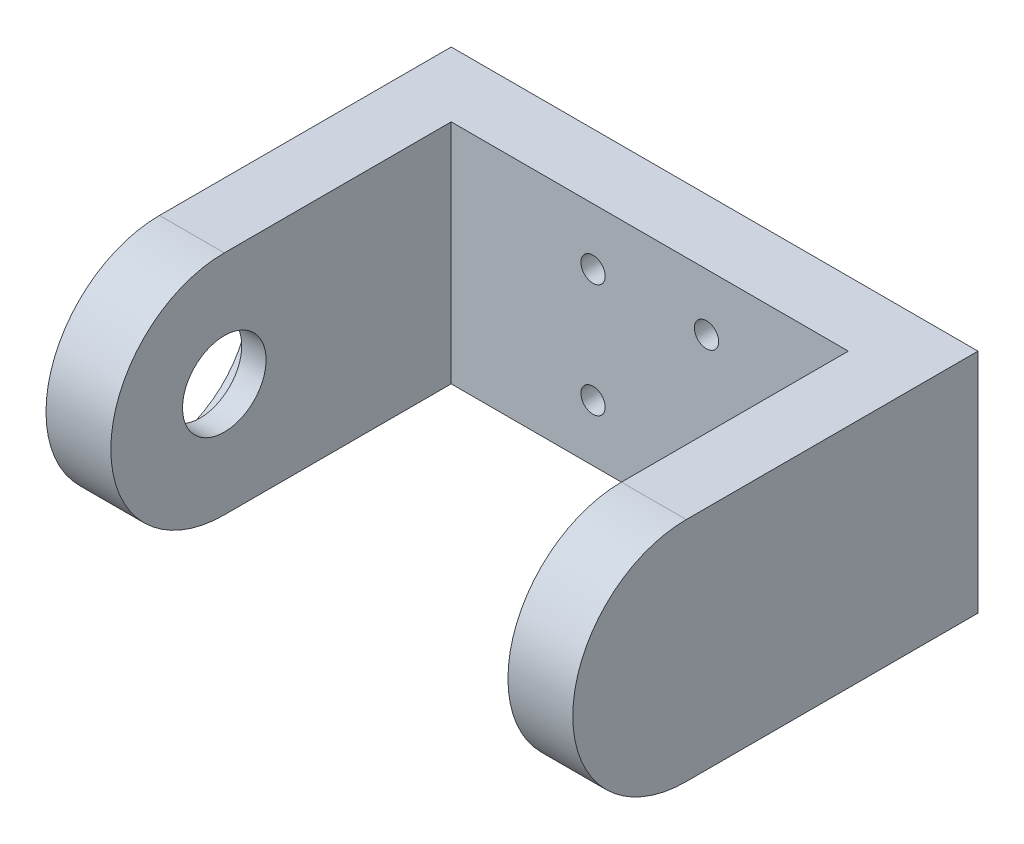
ISO-10303-21;
HEADER;
FILE_DESCRIPTION(('STEP AP214'),'2;1');
FILE_NAME('part.step','',(''),(''),'','','');
FILE_SCHEMA(('AUTOMOTIVE_DESIGN { 1 0 10303 214 1 1 1 1 }'));
ENDSEC;
DATA;
#1=APPLICATION_CONTEXT('core data for automotive mechanical design processes');
#2=APPLICATION_PROTOCOL_DEFINITION('international standard','automotive_design',2000,#1);
#3=PRODUCT_CONTEXT('',#1,'mechanical');
#4=PRODUCT('Part','Part','',(#3));
#5=PRODUCT_RELATED_PRODUCT_CATEGORY('part','',(#4));
#6=PRODUCT_DEFINITION_FORMATION('','',#4);
#7=PRODUCT_DEFINITION_CONTEXT('part definition',#1,'design');
#8=PRODUCT_DEFINITION('design','',#6,#7);
#9=PRODUCT_DEFINITION_SHAPE('','',#8);
#10=(LENGTH_UNIT() NAMED_UNIT(*) SI_UNIT(.MILLI.,.METRE.));
#11=(NAMED_UNIT(*) PLANE_ANGLE_UNIT() SI_UNIT($,.RADIAN.));
#12=(NAMED_UNIT(*) SI_UNIT($,.STERADIAN.) SOLID_ANGLE_UNIT());
#13=UNCERTAINTY_MEASURE_WITH_UNIT(LENGTH_MEASURE(1.E-05),#10,'distance_accuracy_value','');
#14=(GEOMETRIC_REPRESENTATION_CONTEXT(3) GLOBAL_UNCERTAINTY_ASSIGNED_CONTEXT((#13)) GLOBAL_UNIT_ASSIGNED_CONTEXT((#10,
#11,#12)) REPRESENTATION_CONTEXT('',''));
#15=CARTESIAN_POINT('',(0.,0.,0.));
#16=DIRECTION('',(0.,0.,1.));
#17=DIRECTION('',(1.,0.,0.));
#18=AXIS2_PLACEMENT_3D('',#15,#16,#17);
#19=CARTESIAN_POINT('',(0.,0.,8.));
#20=DIRECTION('',(0.,0.,-1.));
#21=DIRECTION('',(-1.,0.,0.));
#22=AXIS2_PLACEMENT_3D('',#19,#20,#21);
#23=PLANE('',#22);
#24=CARTESIAN_POINT('',(39.5,7.,8.));
#25=DIRECTION('',(0.,0.,1.));
#26=DIRECTION('',(1.,0.,0.));
#27=AXIS2_PLACEMENT_3D('',#24,#25,#26);
#28=CIRCLE('',#27,1.5);
#29=CARTESIAN_POINT('',(41.,7.,8.));
#30=VERTEX_POINT('',#29);
#31=EDGE_CURVE('E397',#30,#30,#28,.T.);
#32=ORIENTED_EDGE('',*,*,#31,.F.);
#33=EDGE_LOOP('',(#32));
#34=FACE_BOUND('',#33,.T.);
#35=CARTESIAN_POINT('',(25.5,7.,8.));
#36=DIRECTION('',(0.,0.,1.));
#37=DIRECTION('',(1.,0.,0.));
#38=AXIS2_PLACEMENT_3D('',#35,#36,#37);
#39=CIRCLE('',#38,1.5);
#40=CARTESIAN_POINT('',(27.,7.,8.));
#41=VERTEX_POINT('',#40);
#42=EDGE_CURVE('E399',#41,#41,#39,.T.);
#43=ORIENTED_EDGE('',*,*,#42,.F.);
#44=EDGE_LOOP('',(#43));
#45=FACE_BOUND('',#44,.T.);
#46=CARTESIAN_POINT('',(25.5,21.,8.));
#47=DIRECTION('',(0.,0.,1.));
#48=DIRECTION('',(1.,0.,0.));
#49=AXIS2_PLACEMENT_3D('',#46,#47,#48);
#50=CIRCLE('',#49,1.5);
#51=CARTESIAN_POINT('',(27.,21.,8.));
#52=VERTEX_POINT('',#51);
#53=EDGE_CURVE('E433',#52,#52,#50,.T.);
#54=ORIENTED_EDGE('',*,*,#53,.F.);
#55=EDGE_LOOP('',(#54));
#56=FACE_BOUND('',#55,.T.);
#57=CARTESIAN_POINT('',(39.5,21.,8.));
#58=DIRECTION('',(0.,0.,1.));
#59=DIRECTION('',(1.,0.,0.));
#60=AXIS2_PLACEMENT_3D('',#57,#58,#59);
#61=CIRCLE('',#60,1.5);
#62=CARTESIAN_POINT('',(41.,21.,8.));
#63=VERTEX_POINT('',#62);
#64=EDGE_CURVE('E407',#63,#63,#61,.T.);
#65=ORIENTED_EDGE('',*,*,#64,.F.);
#66=EDGE_LOOP('',(#65));
#67=FACE_BOUND('',#66,.T.);
#68=DIRECTION('',(0.,-1.,0.));
#69=VECTOR('',#68,1.);
#70=CARTESIAN_POINT('',(57.,0.,8.));
#71=LINE('',#70,#69);
#72=CARTESIAN_POINT('',(57.,28.,8.));
#73=VERTEX_POINT('',#72);
#74=CARTESIAN_POINT('',(57.,0.,8.));
#75=VERTEX_POINT('',#74);
#76=EDGE_CURVE('E110',#73,#75,#71,.T.);
#77=ORIENTED_EDGE('',*,*,#76,.F.);
#78=DIRECTION('',(-1.,0.,0.));
#79=VECTOR('',#78,1.);
#80=CARTESIAN_POINT('',(0.,28.,8.));
#81=LINE('',#80,#79);
#82=CARTESIAN_POINT('',(8.,28.,8.));
#83=VERTEX_POINT('',#82);
#84=EDGE_CURVE('E160',#73,#83,#81,.T.);
#85=ORIENTED_EDGE('',*,*,#84,.T.);
#86=DIRECTION('',(0.,1.,0.));
#87=VECTOR('',#86,1.);
#88=CARTESIAN_POINT('',(8.,0.,8.));
#89=LINE('',#88,#87);
#90=CARTESIAN_POINT('',(8.,0.,8.));
#91=VERTEX_POINT('',#90);
#92=EDGE_CURVE('E54',#91,#83,#89,.T.);
#93=ORIENTED_EDGE('',*,*,#92,.F.);
#94=DIRECTION('',(1.,0.,0.));
#95=VECTOR('',#94,1.);
#96=CARTESIAN_POINT('',(0.,0.,8.));
#97=LINE('',#96,#95);
#98=EDGE_CURVE('E49',#91,#75,#97,.T.);
#99=ORIENTED_EDGE('',*,*,#98,.T.);
#100=EDGE_LOOP('',(#77,#85,#93,#99));
#101=FACE_BOUND('',#100,.T.);
#102=ADVANCED_FACE('F33',(#34,#45,#56,#67,#101),#23,.F.);
#103=CARTESIAN_POINT('',(0.,0.,8.));
#104=DIRECTION('',(1.,0.,0.));
#105=DIRECTION('',(0.,0.,-1.));
#106=AXIS2_PLACEMENT_3D('',#103,#104,#105);
#107=PLANE('',#106);
#108=CARTESIAN_POINT('',(0.,14.,36.0000000000001));
#109=DIRECTION('',(-1.,0.,0.));
#110=DIRECTION('',(0.,0.,1.));
#111=AXIS2_PLACEMENT_3D('',#108,#109,#110);
#112=CIRCLE('',#111,11.115);
#113=CARTESIAN_POINT('',(0.,14.,47.1150000000001));
#114=VERTEX_POINT('',#113);
#115=EDGE_CURVE('E130',#114,#114,#112,.T.);
#116=ORIENTED_EDGE('',*,*,#115,.F.);
#117=EDGE_LOOP('',(#116));
#118=FACE_BOUND('',#117,.T.);
#119=DIRECTION('',(0.,0.,-1.));
#120=VECTOR('',#119,1.);
#121=CARTESIAN_POINT('',(0.,0.,8.));
#122=LINE('',#121,#120);
#123=CARTESIAN_POINT('',(0.,0.,36.));
#124=VERTEX_POINT('',#123);
#125=CARTESIAN_POINT('',(0.,0.,0.));
#126=VERTEX_POINT('',#125);
#127=EDGE_CURVE('E11',#124,#126,#122,.T.);
#128=ORIENTED_EDGE('',*,*,#127,.F.);
#129=CARTESIAN_POINT('',(0.,14.,36.));
#130=DIRECTION('',(-1.,0.,0.));
#131=DIRECTION('',(0.,0.,1.));
#132=AXIS2_PLACEMENT_3D('',#129,#130,#131);
#133=CIRCLE('',#132,14.);
#134=CARTESIAN_POINT('',(0.,28.,36.));
#135=VERTEX_POINT('',#134);
#136=EDGE_CURVE('E127',#124,#135,#133,.T.);
#137=ORIENTED_EDGE('',*,*,#136,.T.);
#138=DIRECTION('',(0.,0.,-1.));
#139=VECTOR('',#138,1.);
#140=CARTESIAN_POINT('',(0.,28.,8.));
#141=LINE('',#140,#139);
#142=CARTESIAN_POINT('',(0.,28.,0.));
#143=VERTEX_POINT('',#142);
#144=EDGE_CURVE('E119',#135,#143,#141,.T.);
#145=ORIENTED_EDGE('',*,*,#144,.T.);
#146=DIRECTION('',(0.,-1.,0.));
#147=VECTOR('',#146,1.);
#148=CARTESIAN_POINT('',(0.,0.,0.));
#149=LINE('',#148,#147);
#150=EDGE_CURVE('E158',#143,#126,#149,.T.);
#151=ORIENTED_EDGE('',*,*,#150,.T.);
#152=EDGE_LOOP('',(#128,#137,#145,#151));
#153=FACE_BOUND('',#152,.T.);
#154=ADVANCED_FACE('F35',(#118,#153),#107,.F.);
#155=CARTESIAN_POINT('',(0.,0.,8.));
#156=DIRECTION('',(0.,1.,0.));
#157=DIRECTION('',(0.,0.,1.));
#158=AXIS2_PLACEMENT_3D('',#155,#156,#157);
#159=PLANE('',#158);
#160=DIRECTION('',(1.,0.,0.));
#161=VECTOR('',#160,1.);
#162=CARTESIAN_POINT('',(0.,0.,0.));
#163=LINE('',#162,#161);
#164=CARTESIAN_POINT('',(65.,0.,0.));
#165=VERTEX_POINT('',#164);
#166=EDGE_CURVE('E165',#126,#165,#163,.T.);
#167=ORIENTED_EDGE('',*,*,#166,.T.);
#168=DIRECTION('',(0.,0.,-1.));
#169=VECTOR('',#168,1.);
#170=CARTESIAN_POINT('',(65.,0.,8.));
#171=LINE('',#170,#169);
#172=CARTESIAN_POINT('',(65.,0.,36.));
#173=VERTEX_POINT('',#172);
#174=EDGE_CURVE('E42',#173,#165,#171,.T.);
#175=ORIENTED_EDGE('',*,*,#174,.F.);
#176=DIRECTION('',(1.,0.,0.));
#177=VECTOR('',#176,1.);
#178=CARTESIAN_POINT('',(65.,0.,36.));
#179=LINE('',#178,#177);
#180=CARTESIAN_POINT('',(57.,0.,36.));
#181=VERTEX_POINT('',#180);
#182=EDGE_CURVE('E109',#181,#173,#179,.T.);
#183=ORIENTED_EDGE('',*,*,#182,.F.);
#184=DIRECTION('',(0.,0.,-1.));
#185=VECTOR('',#184,1.);
#186=CARTESIAN_POINT('',(57.,0.,36.));
#187=LINE('',#186,#185);
#188=EDGE_CURVE('E140',#181,#75,#187,.T.);
#189=ORIENTED_EDGE('',*,*,#188,.T.);
#190=ORIENTED_EDGE('',*,*,#98,.F.);
#191=DIRECTION('',(0.,0.,-1.));
#192=VECTOR('',#191,1.);
#193=CARTESIAN_POINT('',(8.,0.,36.));
#194=LINE('',#193,#192);
#195=CARTESIAN_POINT('',(8.,0.,36.));
#196=VERTEX_POINT('',#195);
#197=EDGE_CURVE('E155',#196,#91,#194,.T.);
#198=ORIENTED_EDGE('',*,*,#197,.F.);
#199=DIRECTION('',(1.,0.,0.));
#200=VECTOR('',#199,1.);
#201=CARTESIAN_POINT('',(0.,0.,36.));
#202=LINE('',#201,#200);
#203=EDGE_CURVE('E145',#124,#196,#202,.T.);
#204=ORIENTED_EDGE('',*,*,#203,.F.);
#205=ORIENTED_EDGE('',*,*,#127,.T.);
#206=EDGE_LOOP('',(#167,#175,#183,#189,#190,#198,#204,#205));
#207=FACE_BOUND('',#206,.T.);
#208=ADVANCED_FACE('F184',(#207),#159,.F.);
#209=CARTESIAN_POINT('',(65.,0.,8.));
#210=DIRECTION('',(-1.,0.,0.));
#211=DIRECTION('',(0.,0.,1.));
#212=AXIS2_PLACEMENT_3D('',#209,#210,#211);
#213=PLANE('',#212);
#214=DIRECTION('',(0.,0.,-1.));
#215=VECTOR('',#214,1.);
#216=CARTESIAN_POINT('',(65.,28.,8.));
#217=LINE('',#216,#215);
#218=CARTESIAN_POINT('',(65.,28.,36.));
#219=VERTEX_POINT('',#218);
#220=CARTESIAN_POINT('',(65.,28.,0.));
#221=VERTEX_POINT('',#220);
#222=EDGE_CURVE('E101',#219,#221,#217,.T.);
#223=ORIENTED_EDGE('',*,*,#222,.F.);
#224=CARTESIAN_POINT('',(65.,14.,36.));
#225=DIRECTION('',(1.,0.,0.));
#226=DIRECTION('',(0.,0.,-1.));
#227=AXIS2_PLACEMENT_3D('',#224,#225,#226);
#228=CIRCLE('',#227,14.);
#229=EDGE_CURVE('E116',#219,#173,#228,.T.);
#230=ORIENTED_EDGE('',*,*,#229,.T.);
#231=ORIENTED_EDGE('',*,*,#174,.T.);
#232=DIRECTION('',(0.,1.,0.));
#233=VECTOR('',#232,1.);
#234=CARTESIAN_POINT('',(65.,0.,0.));
#235=LINE('',#234,#233);
#236=EDGE_CURVE('E118',#165,#221,#235,.T.);
#237=ORIENTED_EDGE('',*,*,#236,.T.);
#238=EDGE_LOOP('',(#223,#230,#231,#237));
#239=FACE_BOUND('',#238,.T.);
#240=ADVANCED_FACE('F114',(#239),#213,.F.);
#241=CARTESIAN_POINT('',(0.,28.,8.));
#242=DIRECTION('',(0.,-1.,0.));
#243=DIRECTION('',(0.,0.,-1.));
#244=AXIS2_PLACEMENT_3D('',#241,#242,#243);
#245=PLANE('',#244);
#246=DIRECTION('',(-1.,0.,0.));
#247=VECTOR('',#246,1.);
#248=CARTESIAN_POINT('',(0.,28.,0.));
#249=LINE('',#248,#247);
#250=EDGE_CURVE('E161',#221,#143,#249,.T.);
#251=ORIENTED_EDGE('',*,*,#250,.T.);
#252=ORIENTED_EDGE('',*,*,#144,.F.);
#253=DIRECTION('',(-1.,0.,0.));
#254=VECTOR('',#253,1.);
#255=CARTESIAN_POINT('',(0.,28.,36.));
#256=LINE('',#255,#254);
#257=CARTESIAN_POINT('',(8.,28.,36.));
#258=VERTEX_POINT('',#257);
#259=EDGE_CURVE('E148',#258,#135,#256,.T.);
#260=ORIENTED_EDGE('',*,*,#259,.F.);
#261=DIRECTION('',(0.,0.,-1.));
#262=VECTOR('',#261,1.);
#263=CARTESIAN_POINT('',(8.,28.,36.));
#264=LINE('',#263,#262);
#265=EDGE_CURVE('E151',#258,#83,#264,.T.);
#266=ORIENTED_EDGE('',*,*,#265,.T.);
#267=ORIENTED_EDGE('',*,*,#84,.F.);
#268=DIRECTION('',(0.,0.,-1.));
#269=VECTOR('',#268,1.);
#270=CARTESIAN_POINT('',(57.,28.,36.));
#271=LINE('',#270,#269);
#272=CARTESIAN_POINT('',(57.,28.,36.));
#273=VERTEX_POINT('',#272);
#274=EDGE_CURVE('E104',#273,#73,#271,.T.);
#275=ORIENTED_EDGE('',*,*,#274,.F.);
#276=DIRECTION('',(-1.,0.,0.));
#277=VECTOR('',#276,1.);
#278=CARTESIAN_POINT('',(65.,28.,36.));
#279=LINE('',#278,#277);
#280=EDGE_CURVE('E98',#219,#273,#279,.T.);
#281=ORIENTED_EDGE('',*,*,#280,.F.);
#282=ORIENTED_EDGE('',*,*,#222,.T.);
#283=EDGE_LOOP('',(#251,#252,#260,#266,#267,#275,#281,#282));
#284=FACE_BOUND('',#283,.T.);
#285=ADVANCED_FACE('F100',(#284),#245,.F.);
#286=CARTESIAN_POINT('',(0.,0.,0.));
#287=DIRECTION('',(0.,0.,-1.));
#288=DIRECTION('',(-1.,0.,0.));
#289=AXIS2_PLACEMENT_3D('',#286,#287,#288);
#290=PLANE('',#289);
#291=CARTESIAN_POINT('',(39.5,7.,0.));
#292=DIRECTION('',(0.,0.,1.));
#293=DIRECTION('',(1.,0.,0.));
#294=AXIS2_PLACEMENT_3D('',#291,#292,#293);
#295=CIRCLE('',#294,1.5);
#296=CARTESIAN_POINT('',(41.,7.,0.));
#297=VERTEX_POINT('',#296);
#298=EDGE_CURVE('E395',#297,#297,#295,.T.);
#299=ORIENTED_EDGE('',*,*,#298,.T.);
#300=EDGE_LOOP('',(#299));
#301=FACE_BOUND('',#300,.T.);
#302=CARTESIAN_POINT('',(25.5,7.,0.));
#303=DIRECTION('',(0.,0.,1.));
#304=DIRECTION('',(1.,0.,0.));
#305=AXIS2_PLACEMENT_3D('',#302,#303,#304);
#306=CIRCLE('',#305,1.5);
#307=CARTESIAN_POINT('',(27.,7.,0.));
#308=VERTEX_POINT('',#307);
#309=EDGE_CURVE('E438',#308,#308,#306,.T.);
#310=ORIENTED_EDGE('',*,*,#309,.T.);
#311=EDGE_LOOP('',(#310));
#312=FACE_BOUND('',#311,.T.);
#313=CARTESIAN_POINT('',(25.5,21.,0.));
#314=DIRECTION('',(0.,0.,1.));
#315=DIRECTION('',(1.,0.,0.));
#316=AXIS2_PLACEMENT_3D('',#313,#314,#315);
#317=CIRCLE('',#316,1.5);
#318=CARTESIAN_POINT('',(27.,21.,0.));
#319=VERTEX_POINT('',#318);
#320=EDGE_CURVE('E410',#319,#319,#317,.T.);
#321=ORIENTED_EDGE('',*,*,#320,.T.);
#322=EDGE_LOOP('',(#321));
#323=FACE_BOUND('',#322,.T.);
#324=CARTESIAN_POINT('',(39.5,21.,0.));
#325=DIRECTION('',(0.,0.,1.));
#326=DIRECTION('',(1.,0.,0.));
#327=AXIS2_PLACEMENT_3D('',#324,#325,#326);
#328=CIRCLE('',#327,1.5);
#329=CARTESIAN_POINT('',(41.,21.,0.));
#330=VERTEX_POINT('',#329);
#331=EDGE_CURVE('E403',#330,#330,#328,.T.);
#332=ORIENTED_EDGE('',*,*,#331,.T.);
#333=EDGE_LOOP('',(#332));
#334=FACE_BOUND('',#333,.T.);
#335=ORIENTED_EDGE('',*,*,#150,.F.);
#336=ORIENTED_EDGE('',*,*,#250,.F.);
#337=ORIENTED_EDGE('',*,*,#236,.F.);
#338=ORIENTED_EDGE('',*,*,#166,.F.);
#339=EDGE_LOOP('',(#335,#336,#337,#338));
#340=FACE_BOUND('',#339,.T.);
#341=ADVANCED_FACE('F174',(#301,#312,#323,#334,#340),#290,.T.);
#342=CARTESIAN_POINT('',(8.,0.,36.));
#343=DIRECTION('',(-1.,0.,0.));
#344=DIRECTION('',(0.,0.,1.));
#345=AXIS2_PLACEMENT_3D('',#342,#343,#344);
#346=PLANE('',#345);
#347=CARTESIAN_POINT('',(8.,14.,36.0000000000001));
#348=DIRECTION('',(-1.,0.,0.));
#349=DIRECTION('',(0.,0.,1.));
#350=AXIS2_PLACEMENT_3D('',#347,#348,#349);
#351=CIRCLE('',#350,5.155);
#352=CARTESIAN_POINT('',(8.,14.,41.1550000000001));
#353=VERTEX_POINT('',#352);
#354=EDGE_CURVE('E414',#353,#353,#351,.T.);
#355=ORIENTED_EDGE('',*,*,#354,.T.);
#356=EDGE_LOOP('',(#355));
#357=FACE_BOUND('',#356,.T.);
#358=ORIENTED_EDGE('',*,*,#265,.F.);
#359=CARTESIAN_POINT('',(8.00000000000002,14.,36.));
#360=DIRECTION('',(-1.,0.,0.));
#361=DIRECTION('',(0.,0.,1.));
#362=AXIS2_PLACEMENT_3D('',#359,#360,#361);
#363=CIRCLE('',#362,14.);
#364=EDGE_CURVE('E134',#196,#258,#363,.T.);
#365=ORIENTED_EDGE('',*,*,#364,.F.);
#366=ORIENTED_EDGE('',*,*,#197,.T.);
#367=ORIENTED_EDGE('',*,*,#92,.T.);
#368=EDGE_LOOP('',(#358,#365,#366,#367));
#369=FACE_BOUND('',#368,.T.);
#370=ADVANCED_FACE('F183',(#357,#369),#346,.F.);
#371=CARTESIAN_POINT('',(57.,0.,36.));
#372=DIRECTION('',(1.,0.,0.));
#373=DIRECTION('',(0.,0.,-1.));
#374=AXIS2_PLACEMENT_3D('',#371,#372,#373);
#375=PLANE('',#374);
#376=CARTESIAN_POINT('',(57.,14.,36.));
#377=DIRECTION('',(1.,0.,0.));
#378=DIRECTION('',(0.,0.,-1.));
#379=AXIS2_PLACEMENT_3D('',#376,#377,#378);
#380=CIRCLE('',#379,6.5);
#381=CARTESIAN_POINT('',(57.,14.,29.5));
#382=VERTEX_POINT('',#381);
#383=EDGE_CURVE('E406',#382,#382,#380,.T.);
#384=ORIENTED_EDGE('',*,*,#383,.T.);
#385=EDGE_LOOP('',(#384));
#386=FACE_BOUND('',#385,.T.);
#387=ORIENTED_EDGE('',*,*,#188,.F.);
#388=CARTESIAN_POINT('',(57.,14.,36.));
#389=DIRECTION('',(1.,0.,0.));
#390=DIRECTION('',(0.,0.,-1.));
#391=AXIS2_PLACEMENT_3D('',#388,#389,#390);
#392=CIRCLE('',#391,14.);
#393=EDGE_CURVE('E124',#273,#181,#392,.T.);
#394=ORIENTED_EDGE('',*,*,#393,.F.);
#395=ORIENTED_EDGE('',*,*,#274,.T.);
#396=ORIENTED_EDGE('',*,*,#76,.T.);
#397=EDGE_LOOP('',(#387,#394,#395,#396));
#398=FACE_BOUND('',#397,.T.);
#399=ADVANCED_FACE('F186',(#386,#398),#375,.F.);
#400=CARTESIAN_POINT('',(8.00000000000002,14.,36.));
#401=DIRECTION('',(-1.,0.,0.));
#402=DIRECTION('',(0.,0.,1.));
#403=AXIS2_PLACEMENT_3D('',#400,#401,#402);
#404=CYLINDRICAL_SURFACE('',#403,14.);
#405=ORIENTED_EDGE('',*,*,#203,.T.);
#406=ORIENTED_EDGE('',*,*,#364,.T.);
#407=ORIENTED_EDGE('',*,*,#259,.T.);
#408=ORIENTED_EDGE('',*,*,#136,.F.);
#409=EDGE_LOOP('',(#405,#406,#407,#408));
#410=FACE_BOUND('',#409,.T.);
#411=ADVANCED_FACE('F180',(#410),#404,.T.);
#412=CARTESIAN_POINT('',(57.,14.,36.));
#413=DIRECTION('',(1.,0.,0.));
#414=DIRECTION('',(0.,0.,-1.));
#415=AXIS2_PLACEMENT_3D('',#412,#413,#414);
#416=CYLINDRICAL_SURFACE('',#415,14.);
#417=ORIENTED_EDGE('',*,*,#393,.T.);
#418=ORIENTED_EDGE('',*,*,#182,.T.);
#419=ORIENTED_EDGE('',*,*,#229,.F.);
#420=ORIENTED_EDGE('',*,*,#280,.T.);
#421=EDGE_LOOP('',(#417,#418,#419,#420));
#422=FACE_BOUND('',#421,.T.);
#423=ADVANCED_FACE('F122',(#422),#416,.T.);
#424=CARTESIAN_POINT('',(5.,14.,36.0000000000001));
#425=DIRECTION('',(-1.,0.,0.));
#426=DIRECTION('',(0.,0.,1.));
#427=AXIS2_PLACEMENT_3D('',#424,#425,#426);
#428=CYLINDRICAL_SURFACE('',#427,11.115);
#429=CARTESIAN_POINT('',(5.,14.,36.0000000000001));
#430=DIRECTION('',(-1.,0.,0.));
#431=DIRECTION('',(0.,0.,1.));
#432=AXIS2_PLACEMENT_3D('',#429,#430,#431);
#433=CIRCLE('',#432,11.115);
#434=CARTESIAN_POINT('',(5.,14.,47.1150000000001));
#435=VERTEX_POINT('',#434);
#436=EDGE_CURVE('E125',#435,#435,#433,.T.);
#437=ORIENTED_EDGE('',*,*,#436,.F.);
#438=EDGE_LOOP('',(#437));
#439=FACE_BOUND('',#438,.T.);
#440=ORIENTED_EDGE('',*,*,#115,.T.);
#441=EDGE_LOOP('',(#440));
#442=FACE_BOUND('',#441,.T.);
#443=ADVANCED_FACE('F256',(#439,#442),#428,.F.);
#444=CARTESIAN_POINT('',(5.,14.,36.0000000000001));
#445=DIRECTION('',(-1.,0.,0.));
#446=DIRECTION('',(0.,0.,1.));
#447=AXIS2_PLACEMENT_3D('',#444,#445,#446);
#448=PLANE('',#447);
#449=CARTESIAN_POINT('',(5.,14.,36.0000000000001));
#450=DIRECTION('',(-1.,0.,0.));
#451=DIRECTION('',(0.,0.,1.));
#452=AXIS2_PLACEMENT_3D('',#449,#450,#451);
#453=CIRCLE('',#452,5.155);
#454=CARTESIAN_POINT('',(5.,14.,41.1550000000001));
#455=VERTEX_POINT('',#454);
#456=EDGE_CURVE('E37',#455,#455,#453,.T.);
#457=ORIENTED_EDGE('',*,*,#456,.F.);
#458=EDGE_LOOP('',(#457));
#459=FACE_BOUND('',#458,.T.);
#460=ORIENTED_EDGE('',*,*,#436,.T.);
#461=EDGE_LOOP('',(#460));
#462=FACE_BOUND('',#461,.T.);
#463=ADVANCED_FACE('F262',(#459,#462),#448,.T.);
#464=CARTESIAN_POINT('',(8.,14.,36.0000000000001));
#465=DIRECTION('',(-1.,0.,0.));
#466=DIRECTION('',(0.,0.,1.));
#467=AXIS2_PLACEMENT_3D('',#464,#465,#466);
#468=CYLINDRICAL_SURFACE('',#467,5.155);
#469=ORIENTED_EDGE('',*,*,#456,.T.);
#470=EDGE_LOOP('',(#469));
#471=FACE_BOUND('',#470,.T.);
#472=ORIENTED_EDGE('',*,*,#354,.F.);
#473=EDGE_LOOP('',(#472));
#474=FACE_BOUND('',#473,.T.);
#475=ADVANCED_FACE('F269',(#471,#474),#468,.F.);
#476=CARTESIAN_POINT('',(62.,14.,36.));
#477=DIRECTION('',(-1.,0.,0.));
#478=DIRECTION('',(0.,0.,1.));
#479=AXIS2_PLACEMENT_3D('',#476,#477,#478);
#480=CYLINDRICAL_SURFACE('',#479,6.5);
#481=CARTESIAN_POINT('',(62.,14.,36.));
#482=DIRECTION('',(1.,0.,0.));
#483=DIRECTION('',(0.,0.,-1.));
#484=AXIS2_PLACEMENT_3D('',#481,#482,#483);
#485=CIRCLE('',#484,6.5);
#486=CARTESIAN_POINT('',(62.,14.,29.5));
#487=VERTEX_POINT('',#486);
#488=EDGE_CURVE('E411',#487,#487,#485,.T.);
#489=ORIENTED_EDGE('',*,*,#488,.T.);
#490=EDGE_LOOP('',(#489));
#491=FACE_BOUND('',#490,.T.);
#492=ORIENTED_EDGE('',*,*,#383,.F.);
#493=EDGE_LOOP('',(#492));
#494=FACE_BOUND('',#493,.T.);
#495=ADVANCED_FACE('F276',(#491,#494),#480,.F.);
#496=CARTESIAN_POINT('',(62.,14.,36.));
#497=DIRECTION('',(1.,0.,0.));
#498=DIRECTION('',(0.,0.,-1.));
#499=AXIS2_PLACEMENT_3D('',#496,#497,#498);
#500=PLANE('',#499);
#501=ORIENTED_EDGE('',*,*,#488,.F.);
#502=EDGE_LOOP('',(#501));
#503=FACE_BOUND('',#502,.T.);
#504=ADVANCED_FACE('F283',(#503),#500,.F.);
#505=CARTESIAN_POINT('',(39.5,21.,0.));
#506=DIRECTION('',(0.,0.,1.));
#507=DIRECTION('',(1.,0.,0.));
#508=AXIS2_PLACEMENT_3D('',#505,#506,#507);
#509=CYLINDRICAL_SURFACE('',#508,1.5);
#510=ORIENTED_EDGE('',*,*,#331,.F.);
#511=EDGE_LOOP('',(#510));
#512=FACE_BOUND('',#511,.T.);
#513=ORIENTED_EDGE('',*,*,#64,.T.);
#514=EDGE_LOOP('',(#513));
#515=FACE_BOUND('',#514,.T.);
#516=ADVANCED_FACE('F290',(#512,#515),#509,.F.);
#517=CARTESIAN_POINT('',(25.5,21.,0.));
#518=DIRECTION('',(0.,0.,1.));
#519=DIRECTION('',(1.,0.,0.));
#520=AXIS2_PLACEMENT_3D('',#517,#518,#519);
#521=CYLINDRICAL_SURFACE('',#520,1.5);
#522=ORIENTED_EDGE('',*,*,#320,.F.);
#523=EDGE_LOOP('',(#522));
#524=FACE_BOUND('',#523,.T.);
#525=ORIENTED_EDGE('',*,*,#53,.T.);
#526=EDGE_LOOP('',(#525));
#527=FACE_BOUND('',#526,.T.);
#528=ADVANCED_FACE('F297',(#524,#527),#521,.F.);
#529=CARTESIAN_POINT('',(25.5,7.,0.));
#530=DIRECTION('',(0.,0.,1.));
#531=DIRECTION('',(1.,0.,0.));
#532=AXIS2_PLACEMENT_3D('',#529,#530,#531);
#533=CYLINDRICAL_SURFACE('',#532,1.5);
#534=ORIENTED_EDGE('',*,*,#309,.F.);
#535=EDGE_LOOP('',(#534));
#536=FACE_BOUND('',#535,.T.);
#537=ORIENTED_EDGE('',*,*,#42,.T.);
#538=EDGE_LOOP('',(#537));
#539=FACE_BOUND('',#538,.T.);
#540=ADVANCED_FACE('F305',(#536,#539),#533,.F.);
#541=CARTESIAN_POINT('',(39.5,7.,0.));
#542=DIRECTION('',(0.,0.,1.));
#543=DIRECTION('',(1.,0.,0.));
#544=AXIS2_PLACEMENT_3D('',#541,#542,#543);
#545=CYLINDRICAL_SURFACE('',#544,1.5);
#546=ORIENTED_EDGE('',*,*,#298,.F.);
#547=EDGE_LOOP('',(#546));
#548=FACE_BOUND('',#547,.T.);
#549=ORIENTED_EDGE('',*,*,#31,.T.);
#550=EDGE_LOOP('',(#549));
#551=FACE_BOUND('',#550,.T.);
#552=ADVANCED_FACE('F313',(#548,#551),#545,.F.);
#553=CLOSED_SHELL('',(#102,#154,#208,#240,#285,#341,#370,#399,#411,#423,#443,#463,#475,#495,
#504,#516,#528,#540,#552));
#554=MANIFOLD_SOLID_BREP('B2',#553);
#555=ADVANCED_BREP_SHAPE_REPRESENTATION('',(#18,#554),#14);
#556=SHAPE_DEFINITION_REPRESENTATION(#9,#555);
ENDSEC;
END-ISO-10303-21;
